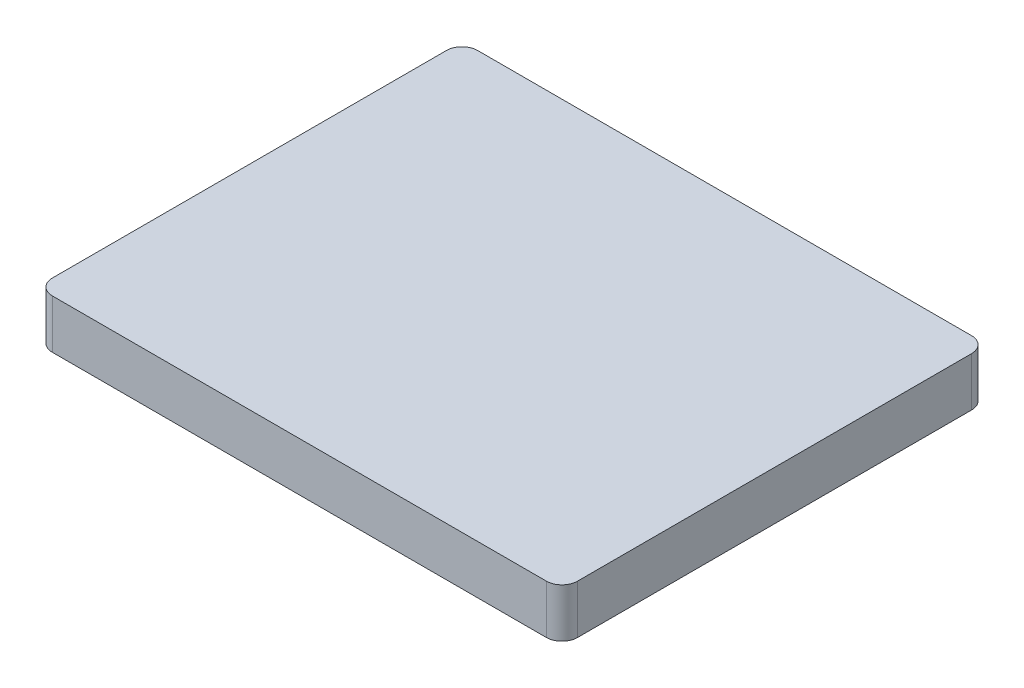
ISO-10303-21;
HEADER;
FILE_DESCRIPTION(('STEP AP214'),'2;1');
FILE_NAME('part.step','',(''),(''),'','','');
FILE_SCHEMA(('AUTOMOTIVE_DESIGN { 1 0 10303 214 1 1 1 1 }'));
ENDSEC;
DATA;
#1=APPLICATION_CONTEXT('core data for automotive mechanical design processes');
#2=APPLICATION_PROTOCOL_DEFINITION('international standard','automotive_design',2000,#1);
#3=PRODUCT_CONTEXT('',#1,'mechanical');
#4=PRODUCT('Part','Part','',(#3));
#5=PRODUCT_RELATED_PRODUCT_CATEGORY('part','',(#4));
#6=PRODUCT_DEFINITION_FORMATION('','',#4);
#7=PRODUCT_DEFINITION_CONTEXT('part definition',#1,'design');
#8=PRODUCT_DEFINITION('design','',#6,#7);
#9=PRODUCT_DEFINITION_SHAPE('','',#8);
#10=(LENGTH_UNIT() NAMED_UNIT(*) SI_UNIT(.MILLI.,.METRE.));
#11=(NAMED_UNIT(*) PLANE_ANGLE_UNIT() SI_UNIT($,.RADIAN.));
#12=(NAMED_UNIT(*) SI_UNIT($,.STERADIAN.) SOLID_ANGLE_UNIT());
#13=UNCERTAINTY_MEASURE_WITH_UNIT(LENGTH_MEASURE(1.E-05),#10,'distance_accuracy_value','');
#14=(GEOMETRIC_REPRESENTATION_CONTEXT(3) GLOBAL_UNCERTAINTY_ASSIGNED_CONTEXT((#13)) GLOBAL_UNIT_ASSIGNED_CONTEXT((#10,
#11,#12)) REPRESENTATION_CONTEXT('',''));
#15=CARTESIAN_POINT('',(0.,0.,0.));
#16=DIRECTION('',(0.,0.,1.));
#17=DIRECTION('',(1.,0.,0.));
#18=AXIS2_PLACEMENT_3D('',#15,#16,#17);
#19=CARTESIAN_POINT('',(10.875,17.7531010026189,8.375));
#20=DIRECTION('',(0.,1.,0.));
#21=DIRECTION('',(0.,0.,1.));
#22=AXIS2_PLACEMENT_3D('',#19,#20,#21);
#23=CYLINDRICAL_SURFACE('',#22,0.7);
#24=DIRECTION('',(0.,1.,0.));
#25=VECTOR('',#24,1.);
#26=CARTESIAN_POINT('',(10.875,17.7531010026189,9.075));
#27=LINE('',#26,#25);
#28=CARTESIAN_POINT('',(10.875,18.,9.075));
#29=VERTEX_POINT('',#28);
#30=CARTESIAN_POINT('',(10.875,20.2,9.075));
#31=VERTEX_POINT('',#30);
#32=EDGE_CURVE('E149',#29,#31,#27,.T.);
#33=ORIENTED_EDGE('',*,*,#32,.F.);
#34=CARTESIAN_POINT('',(10.875,18.,8.375));
#35=DIRECTION('',(0.,1.,0.));
#36=DIRECTION('',(0.,0.,1.));
#37=AXIS2_PLACEMENT_3D('',#34,#35,#36);
#38=CIRCLE('',#37,0.7);
#39=CARTESIAN_POINT('',(11.575,18.,8.375));
#40=VERTEX_POINT('',#39);
#41=EDGE_CURVE('E144',#29,#40,#38,.T.);
#42=ORIENTED_EDGE('',*,*,#41,.T.);
#43=DIRECTION('',(0.,1.,0.));
#44=VECTOR('',#43,1.);
#45=CARTESIAN_POINT('',(11.575,17.7531010026189,8.375));
#46=LINE('',#45,#44);
#47=CARTESIAN_POINT('',(11.575,20.2,8.375));
#48=VERTEX_POINT('',#47);
#49=EDGE_CURVE('E11',#40,#48,#46,.T.);
#50=ORIENTED_EDGE('',*,*,#49,.T.);
#51=CARTESIAN_POINT('',(10.875,20.2,8.375));
#52=DIRECTION('',(0.,1.,0.));
#53=DIRECTION('',(0.,0.,1.));
#54=AXIS2_PLACEMENT_3D('',#51,#52,#53);
#55=CIRCLE('',#54,0.7);
#56=EDGE_CURVE('E127',#48,#31,#55,.F.);
#57=ORIENTED_EDGE('',*,*,#56,.T.);
#58=EDGE_LOOP('',(#33,#42,#50,#57));
#59=FACE_BOUND('',#58,.T.);
#60=ADVANCED_FACE('F42',(#59),#23,.T.);
#61=CARTESIAN_POINT('',(-11.375,17.7531010026189,9.075));
#62=DIRECTION('',(0.,0.,1.));
#63=DIRECTION('',(1.,0.,0.));
#64=AXIS2_PLACEMENT_3D('',#61,#62,#63);
#65=PLANE('',#64);
#66=DIRECTION('',(0.,1.,0.));
#67=VECTOR('',#66,1.);
#68=CARTESIAN_POINT('',(-11.375,17.7531010026189,9.075));
#69=LINE('',#68,#67);
#70=CARTESIAN_POINT('',(-11.375,18.,9.075));
#71=VERTEX_POINT('',#70);
#72=CARTESIAN_POINT('',(-11.375,20.2,9.075));
#73=VERTEX_POINT('',#72);
#74=EDGE_CURVE('E151',#71,#73,#69,.T.);
#75=ORIENTED_EDGE('',*,*,#74,.F.);
#76=DIRECTION('',(1.,0.,0.));
#77=VECTOR('',#76,1.);
#78=CARTESIAN_POINT('',(0.,18.,9.075));
#79=LINE('',#78,#77);
#80=EDGE_CURVE('E141',#71,#29,#79,.T.);
#81=ORIENTED_EDGE('',*,*,#80,.T.);
#82=ORIENTED_EDGE('',*,*,#32,.T.);
#83=DIRECTION('',(-1.,0.,0.));
#84=VECTOR('',#83,1.);
#85=CARTESIAN_POINT('',(-0.25,20.2,9.075));
#86=LINE('',#85,#84);
#87=EDGE_CURVE('E130',#31,#73,#86,.T.);
#88=ORIENTED_EDGE('',*,*,#87,.T.);
#89=EDGE_LOOP('',(#75,#81,#82,#88));
#90=FACE_BOUND('',#89,.T.);
#91=ADVANCED_FACE('F194',(#90),#65,.T.);
#92=CARTESIAN_POINT('',(11.575,17.7531010026189,-9.375));
#93=DIRECTION('',(1.,0.,0.));
#94=DIRECTION('',(0.,0.,-1.));
#95=AXIS2_PLACEMENT_3D('',#92,#93,#94);
#96=PLANE('',#95);
#97=ORIENTED_EDGE('',*,*,#49,.F.);
#98=DIRECTION('',(0.,0.,-1.));
#99=VECTOR('',#98,1.);
#100=CARTESIAN_POINT('',(11.575,18.,0.));
#101=LINE('',#100,#99);
#102=CARTESIAN_POINT('',(11.575,18.,-9.375));
#103=VERTEX_POINT('',#102);
#104=EDGE_CURVE('E147',#40,#103,#101,.T.);
#105=ORIENTED_EDGE('',*,*,#104,.T.);
#106=DIRECTION('',(0.,1.,0.));
#107=VECTOR('',#106,1.);
#108=CARTESIAN_POINT('',(11.575,17.7531010026189,-9.375));
#109=LINE('',#108,#107);
#110=CARTESIAN_POINT('',(11.575,20.2,-9.375));
#111=VERTEX_POINT('',#110);
#112=EDGE_CURVE('E51',#103,#111,#109,.T.);
#113=ORIENTED_EDGE('',*,*,#112,.T.);
#114=DIRECTION('',(0.,0.,1.));
#115=VECTOR('',#114,1.);
#116=CARTESIAN_POINT('',(11.575,20.2,8.375));
#117=LINE('',#116,#115);
#118=EDGE_CURVE('E183',#111,#48,#117,.T.);
#119=ORIENTED_EDGE('',*,*,#118,.T.);
#120=EDGE_LOOP('',(#97,#105,#113,#119));
#121=FACE_BOUND('',#120,.T.);
#122=ADVANCED_FACE('F210',(#121),#96,.T.);
#123=CARTESIAN_POINT('',(10.875,17.7531010026189,-9.375));
#124=DIRECTION('',(0.,1.,0.));
#125=DIRECTION('',(0.,0.,1.));
#126=AXIS2_PLACEMENT_3D('',#123,#124,#125);
#127=CYLINDRICAL_SURFACE('',#126,0.699999999999999);
#128=ORIENTED_EDGE('',*,*,#112,.F.);
#129=CARTESIAN_POINT('',(10.875,18.,-9.375));
#130=DIRECTION('',(0.,1.,0.));
#131=DIRECTION('',(0.,0.,1.));
#132=AXIS2_PLACEMENT_3D('',#129,#130,#131);
#133=CIRCLE('',#132,0.699999999999999);
#134=CARTESIAN_POINT('',(10.875,18.,-10.075));
#135=VERTEX_POINT('',#134);
#136=EDGE_CURVE('E121',#103,#135,#133,.T.);
#137=ORIENTED_EDGE('',*,*,#136,.T.);
#138=DIRECTION('',(0.,1.,0.));
#139=VECTOR('',#138,1.);
#140=CARTESIAN_POINT('',(10.875,17.7531010026189,-10.075));
#141=LINE('',#140,#139);
#142=CARTESIAN_POINT('',(10.875,20.2,-10.075));
#143=VERTEX_POINT('',#142);
#144=EDGE_CURVE('E66',#135,#143,#141,.T.);
#145=ORIENTED_EDGE('',*,*,#144,.T.);
#146=CARTESIAN_POINT('',(10.875,20.2,-9.375));
#147=DIRECTION('',(0.,1.,0.));
#148=DIRECTION('',(0.,0.,1.));
#149=AXIS2_PLACEMENT_3D('',#146,#147,#148);
#150=CIRCLE('',#149,0.7);
#151=EDGE_CURVE('E115',#143,#111,#150,.F.);
#152=ORIENTED_EDGE('',*,*,#151,.T.);
#153=EDGE_LOOP('',(#128,#137,#145,#152));
#154=FACE_BOUND('',#153,.T.);
#155=ADVANCED_FACE('F126',(#154),#127,.T.);
#156=CARTESIAN_POINT('',(-12.075,17.7531010026189,-9.375));
#157=DIRECTION('',(-1.,0.,0.));
#158=DIRECTION('',(0.,0.,1.));
#159=AXIS2_PLACEMENT_3D('',#156,#157,#158);
#160=PLANE('',#159);
#161=DIRECTION('',(0.,1.,0.));
#162=VECTOR('',#161,1.);
#163=CARTESIAN_POINT('',(-12.075,17.7531010026189,-9.375));
#164=LINE('',#163,#162);
#165=CARTESIAN_POINT('',(-12.075,18.,-9.375));
#166=VERTEX_POINT('',#165);
#167=CARTESIAN_POINT('',(-12.075,20.2,-9.375));
#168=VERTEX_POINT('',#167);
#169=EDGE_CURVE('E159',#166,#168,#164,.T.);
#170=ORIENTED_EDGE('',*,*,#169,.F.);
#171=DIRECTION('',(0.,0.,1.));
#172=VECTOR('',#171,1.);
#173=CARTESIAN_POINT('',(-12.075,18.,0.));
#174=LINE('',#173,#172);
#175=CARTESIAN_POINT('',(-12.075,18.,8.375));
#176=VERTEX_POINT('',#175);
#177=EDGE_CURVE('E135',#166,#176,#174,.T.);
#178=ORIENTED_EDGE('',*,*,#177,.T.);
#179=DIRECTION('',(0.,1.,0.));
#180=VECTOR('',#179,1.);
#181=CARTESIAN_POINT('',(-12.075,17.7531010026189,8.375));
#182=LINE('',#181,#180);
#183=CARTESIAN_POINT('',(-12.075,20.2,8.375));
#184=VERTEX_POINT('',#183);
#185=EDGE_CURVE('E161',#176,#184,#182,.T.);
#186=ORIENTED_EDGE('',*,*,#185,.T.);
#187=DIRECTION('',(0.,0.,-1.));
#188=VECTOR('',#187,1.);
#189=CARTESIAN_POINT('',(-12.075,20.2,8.375));
#190=LINE('',#189,#188);
#191=EDGE_CURVE('E180',#184,#168,#190,.T.);
#192=ORIENTED_EDGE('',*,*,#191,.T.);
#193=EDGE_LOOP('',(#170,#178,#186,#192));
#194=FACE_BOUND('',#193,.T.);
#195=ADVANCED_FACE('F202',(#194),#160,.T.);
#196=CARTESIAN_POINT('',(-11.375,17.7531010026189,-9.375));
#197=DIRECTION('',(0.,1.,0.));
#198=DIRECTION('',(0.,0.,1.));
#199=AXIS2_PLACEMENT_3D('',#196,#197,#198);
#200=CYLINDRICAL_SURFACE('',#199,0.699999999999999);
#201=DIRECTION('',(0.,1.,0.));
#202=VECTOR('',#201,1.);
#203=CARTESIAN_POINT('',(-11.375,17.7531010026189,-10.075));
#204=LINE('',#203,#202);
#205=CARTESIAN_POINT('',(-11.375,18.,-10.075));
#206=VERTEX_POINT('',#205);
#207=CARTESIAN_POINT('',(-11.375,20.2,-10.075));
#208=VERTEX_POINT('',#207);
#209=EDGE_CURVE('E114',#206,#208,#204,.T.);
#210=ORIENTED_EDGE('',*,*,#209,.F.);
#211=CARTESIAN_POINT('',(-11.375,18.,-9.375));
#212=DIRECTION('',(0.,1.,0.));
#213=DIRECTION('',(0.,0.,1.));
#214=AXIS2_PLACEMENT_3D('',#211,#212,#213);
#215=CIRCLE('',#214,0.699999999999999);
#216=EDGE_CURVE('E124',#206,#166,#215,.T.);
#217=ORIENTED_EDGE('',*,*,#216,.T.);
#218=ORIENTED_EDGE('',*,*,#169,.T.);
#219=CARTESIAN_POINT('',(-11.375,20.2,-9.375));
#220=DIRECTION('',(0.,1.,0.));
#221=DIRECTION('',(0.,0.,1.));
#222=AXIS2_PLACEMENT_3D('',#219,#220,#221);
#223=CIRCLE('',#222,0.7);
#224=EDGE_CURVE('E174',#168,#208,#223,.F.);
#225=ORIENTED_EDGE('',*,*,#224,.T.);
#226=EDGE_LOOP('',(#210,#217,#218,#225));
#227=FACE_BOUND('',#226,.T.);
#228=ADVANCED_FACE('F175',(#227),#200,.T.);
#229=CARTESIAN_POINT('',(-11.375,17.7531010026189,8.375));
#230=DIRECTION('',(0.,1.,0.));
#231=DIRECTION('',(0.,0.,1.));
#232=AXIS2_PLACEMENT_3D('',#229,#230,#231);
#233=CYLINDRICAL_SURFACE('',#232,0.699999999999999);
#234=ORIENTED_EDGE('',*,*,#185,.F.);
#235=CARTESIAN_POINT('',(-11.375,18.,8.375));
#236=DIRECTION('',(0.,1.,0.));
#237=DIRECTION('',(0.,0.,1.));
#238=AXIS2_PLACEMENT_3D('',#235,#236,#237);
#239=CIRCLE('',#238,0.699999999999999);
#240=EDGE_CURVE('E138',#176,#71,#239,.T.);
#241=ORIENTED_EDGE('',*,*,#240,.T.);
#242=ORIENTED_EDGE('',*,*,#74,.T.);
#243=CARTESIAN_POINT('',(-11.375,20.2,8.375));
#244=DIRECTION('',(0.,1.,0.));
#245=DIRECTION('',(0.,0.,1.));
#246=AXIS2_PLACEMENT_3D('',#243,#244,#245);
#247=CIRCLE('',#246,0.7);
#248=EDGE_CURVE('E179',#73,#184,#247,.F.);
#249=ORIENTED_EDGE('',*,*,#248,.T.);
#250=EDGE_LOOP('',(#234,#241,#242,#249));
#251=FACE_BOUND('',#250,.T.);
#252=ADVANCED_FACE('F198',(#251),#233,.T.);
#253=CARTESIAN_POINT('',(-11.375,17.7531010026189,-10.075));
#254=DIRECTION('',(0.,0.,-1.));
#255=DIRECTION('',(-1.,0.,0.));
#256=AXIS2_PLACEMENT_3D('',#253,#254,#255);
#257=PLANE('',#256);
#258=ORIENTED_EDGE('',*,*,#144,.F.);
#259=DIRECTION('',(-1.,0.,0.));
#260=VECTOR('',#259,1.);
#261=CARTESIAN_POINT('',(0.,18.,-10.075));
#262=LINE('',#261,#260);
#263=EDGE_CURVE('E110',#135,#206,#262,.T.);
#264=ORIENTED_EDGE('',*,*,#263,.T.);
#265=ORIENTED_EDGE('',*,*,#209,.T.);
#266=DIRECTION('',(1.,0.,0.));
#267=VECTOR('',#266,1.);
#268=CARTESIAN_POINT('',(-0.25,20.2,-10.075));
#269=LINE('',#268,#267);
#270=EDGE_CURVE('E112',#208,#143,#269,.T.);
#271=ORIENTED_EDGE('',*,*,#270,.T.);
#272=EDGE_LOOP('',(#258,#264,#265,#271));
#273=FACE_BOUND('',#272,.T.);
#274=ADVANCED_FACE('F109',(#273),#257,.T.);
#275=CARTESIAN_POINT('',(0.,20.2,0.));
#276=DIRECTION('',(0.,1.,0.));
#277=DIRECTION('',(0.,0.,1.));
#278=AXIS2_PLACEMENT_3D('',#275,#276,#277);
#279=PLANE('',#278);
#280=ORIENTED_EDGE('',*,*,#270,.F.);
#281=ORIENTED_EDGE('',*,*,#224,.F.);
#282=ORIENTED_EDGE('',*,*,#191,.F.);
#283=ORIENTED_EDGE('',*,*,#248,.F.);
#284=ORIENTED_EDGE('',*,*,#87,.F.);
#285=ORIENTED_EDGE('',*,*,#56,.F.);
#286=ORIENTED_EDGE('',*,*,#118,.F.);
#287=ORIENTED_EDGE('',*,*,#151,.F.);
#288=EDGE_LOOP('',(#280,#281,#282,#283,#284,#285,#286,#287));
#289=FACE_BOUND('',#288,.T.);
#290=ADVANCED_FACE('F182',(#289),#279,.T.);
#291=CARTESIAN_POINT('',(0.,18.,0.));
#292=DIRECTION('',(0.,1.,0.));
#293=DIRECTION('',(1.,0.,0.));
#294=AXIS2_PLACEMENT_3D('',#291,#292,#293);
#295=PLANE('',#294);
#296=ORIENTED_EDGE('',*,*,#136,.F.);
#297=ORIENTED_EDGE('',*,*,#104,.F.);
#298=ORIENTED_EDGE('',*,*,#41,.F.);
#299=ORIENTED_EDGE('',*,*,#80,.F.);
#300=ORIENTED_EDGE('',*,*,#240,.F.);
#301=ORIENTED_EDGE('',*,*,#177,.F.);
#302=ORIENTED_EDGE('',*,*,#216,.F.);
#303=ORIENTED_EDGE('',*,*,#263,.F.);
#304=EDGE_LOOP('',(#296,#297,#298,#299,#300,#301,#302,#303));
#305=FACE_BOUND('',#304,.T.);
#306=ADVANCED_FACE('F44',(#305),#295,.F.);
#307=CLOSED_SHELL('',(#60,#91,#122,#155,#195,#228,#252,#274,#290,#306));
#308=MANIFOLD_SOLID_BREP('B2',#307);
#309=ADVANCED_BREP_SHAPE_REPRESENTATION('',(#18,#308),#14);
#310=SHAPE_DEFINITION_REPRESENTATION(#9,#309);
ENDSEC;
END-ISO-10303-21;
